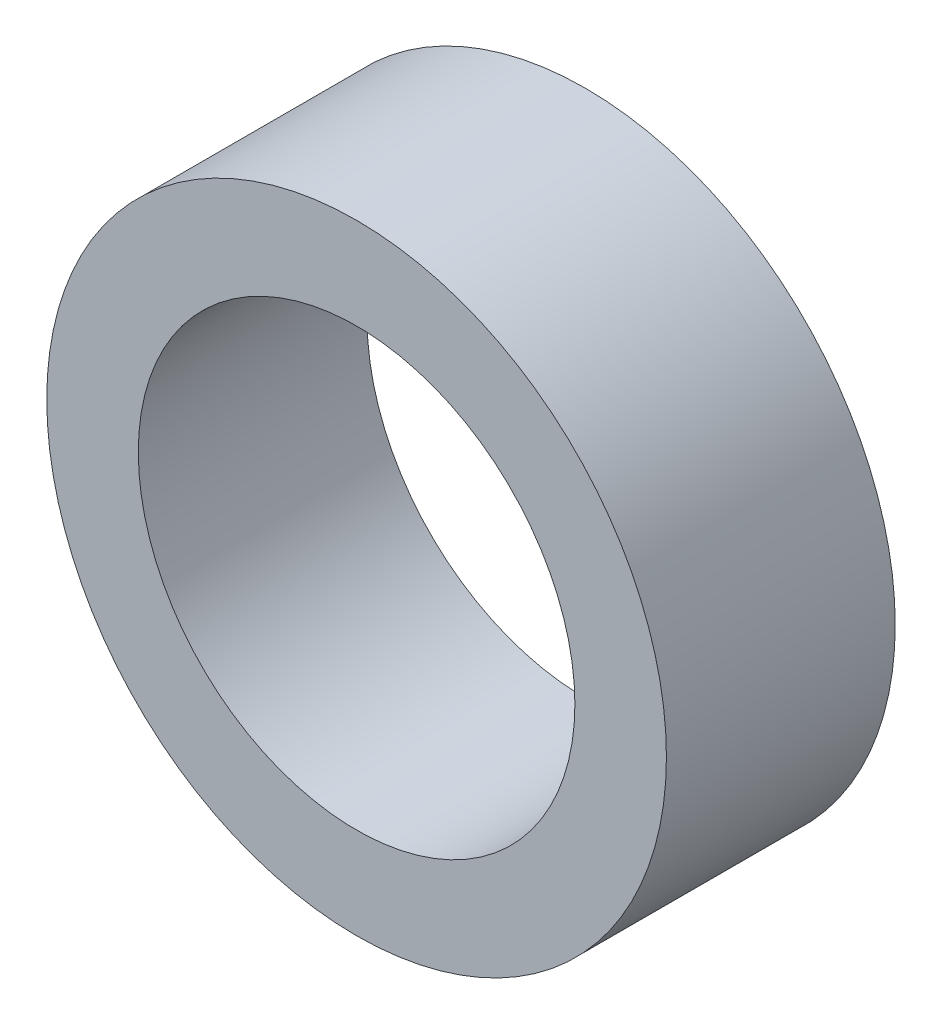
ISO-10303-21;
HEADER;
FILE_DESCRIPTION(('STEP AP214'),'2;1');
FILE_NAME('part.step','',(''),(''),'','','');
FILE_SCHEMA(('AUTOMOTIVE_DESIGN { 1 0 10303 214 1 1 1 1 }'));
ENDSEC;
DATA;
#1=APPLICATION_CONTEXT('core data for automotive mechanical design processes');
#2=APPLICATION_PROTOCOL_DEFINITION('international standard','automotive_design',2000,#1);
#3=PRODUCT_CONTEXT('',#1,'mechanical');
#4=PRODUCT('Part','Part','',(#3));
#5=PRODUCT_RELATED_PRODUCT_CATEGORY('part','',(#4));
#6=PRODUCT_DEFINITION_FORMATION('','',#4);
#7=PRODUCT_DEFINITION_CONTEXT('part definition',#1,'design');
#8=PRODUCT_DEFINITION('design','',#6,#7);
#9=PRODUCT_DEFINITION_SHAPE('','',#8);
#10=(LENGTH_UNIT() NAMED_UNIT(*) SI_UNIT(.MILLI.,.METRE.));
#11=(NAMED_UNIT(*) PLANE_ANGLE_UNIT() SI_UNIT($,.RADIAN.));
#12=(NAMED_UNIT(*) SI_UNIT($,.STERADIAN.) SOLID_ANGLE_UNIT());
#13=UNCERTAINTY_MEASURE_WITH_UNIT(LENGTH_MEASURE(1.E-05),#10,'distance_accuracy_value','');
#14=(GEOMETRIC_REPRESENTATION_CONTEXT(3) GLOBAL_UNCERTAINTY_ASSIGNED_CONTEXT((#13)) GLOBAL_UNIT_ASSIGNED_CONTEXT((#10,
#11,#12)) REPRESENTATION_CONTEXT('',''));
#15=CARTESIAN_POINT('',(0.,0.,0.));
#16=DIRECTION('',(0.,0.,1.));
#17=DIRECTION('',(1.,0.,0.));
#18=AXIS2_PLACEMENT_3D('',#15,#16,#17);
#19=CARTESIAN_POINT('',(0.,0.,6.35));
#20=DIRECTION('',(0.,0.,1.));
#21=DIRECTION('',(1.,0.,0.));
#22=AXIS2_PLACEMENT_3D('',#19,#20,#21);
#23=PLANE('',#22);
#24=CARTESIAN_POINT('',(0.,0.,6.35));
#25=DIRECTION('',(0.,0.,1.));
#26=DIRECTION('',(1.,0.,0.));
#27=AXIS2_PLACEMENT_3D('',#24,#25,#26);
#28=CIRCLE('',#27,8.598499948);
#29=CARTESIAN_POINT('',(8.598499948,0.,6.35));
#30=VERTEX_POINT('',#29);
#31=EDGE_CURVE('E10',#30,#30,#28,.T.);
#32=ORIENTED_EDGE('',*,*,#31,.T.);
#33=EDGE_LOOP('',(#32));
#34=FACE_BOUND('',#33,.T.);
#35=CARTESIAN_POINT('',(0.,0.,6.35));
#36=DIRECTION('',(0.,0.,1.));
#37=DIRECTION('',(1.,0.,0.));
#38=AXIS2_PLACEMENT_3D('',#35,#36,#37);
#39=CIRCLE('',#38,6.058499948);
#40=CARTESIAN_POINT('',(6.058499948,0.,6.35));
#41=VERTEX_POINT('',#40);
#42=EDGE_CURVE('E48',#41,#41,#39,.T.);
#43=ORIENTED_EDGE('',*,*,#42,.F.);
#44=EDGE_LOOP('',(#43));
#45=FACE_BOUND('',#44,.T.);
#46=ADVANCED_FACE('F37',(#34,#45),#23,.T.);
#47=CARTESIAN_POINT('',(0.,0.,0.));
#48=DIRECTION('',(0.,0.,1.));
#49=DIRECTION('',(1.,0.,0.));
#50=AXIS2_PLACEMENT_3D('',#47,#48,#49);
#51=PLANE('',#50);
#52=CARTESIAN_POINT('',(0.,0.,0.));
#53=DIRECTION('',(0.,0.,1.));
#54=DIRECTION('',(1.,0.,0.));
#55=AXIS2_PLACEMENT_3D('',#52,#53,#54);
#56=CIRCLE('',#55,8.598499948);
#57=CARTESIAN_POINT('',(8.598499948,0.,0.));
#58=VERTEX_POINT('',#57);
#59=EDGE_CURVE('E41',#58,#58,#56,.T.);
#60=ORIENTED_EDGE('',*,*,#59,.F.);
#61=EDGE_LOOP('',(#60));
#62=FACE_BOUND('',#61,.T.);
#63=CARTESIAN_POINT('',(0.,0.,0.));
#64=DIRECTION('',(0.,0.,1.));
#65=DIRECTION('',(1.,0.,0.));
#66=AXIS2_PLACEMENT_3D('',#63,#64,#65);
#67=CIRCLE('',#66,6.058499948);
#68=CARTESIAN_POINT('',(6.058499948,0.,0.));
#69=VERTEX_POINT('',#68);
#70=EDGE_CURVE('E50',#69,#69,#67,.T.);
#71=ORIENTED_EDGE('',*,*,#70,.T.);
#72=EDGE_LOOP('',(#71));
#73=FACE_BOUND('',#72,.T.);
#74=ADVANCED_FACE('F60',(#62,#73),#51,.F.);
#75=CARTESIAN_POINT('',(0.,0.,6.35));
#76=DIRECTION('',(0.,0.,-1.));
#77=DIRECTION('',(-1.,0.,0.));
#78=AXIS2_PLACEMENT_3D('',#75,#76,#77);
#79=CYLINDRICAL_SURFACE('',#78,8.598499948);
#80=ORIENTED_EDGE('',*,*,#31,.F.);
#81=EDGE_LOOP('',(#80));
#82=FACE_BOUND('',#81,.T.);
#83=ORIENTED_EDGE('',*,*,#59,.T.);
#84=EDGE_LOOP('',(#83));
#85=FACE_BOUND('',#84,.T.);
#86=ADVANCED_FACE('F39',(#82,#85),#79,.T.);
#87=CARTESIAN_POINT('',(0.,0.,6.35));
#88=DIRECTION('',(0.,0.,-1.));
#89=DIRECTION('',(-1.,0.,0.));
#90=AXIS2_PLACEMENT_3D('',#87,#88,#89);
#91=CYLINDRICAL_SURFACE('',#90,6.058499948);
#92=ORIENTED_EDGE('',*,*,#42,.T.);
#93=EDGE_LOOP('',(#92));
#94=FACE_BOUND('',#93,.T.);
#95=ORIENTED_EDGE('',*,*,#70,.F.);
#96=EDGE_LOOP('',(#95));
#97=FACE_BOUND('',#96,.T.);
#98=ADVANCED_FACE('F56',(#94,#97),#91,.F.);
#99=CLOSED_SHELL('',(#46,#74,#86,#98));
#100=MANIFOLD_SOLID_BREP('B2',#99);
#101=ADVANCED_BREP_SHAPE_REPRESENTATION('',(#18,#100),#14);
#102=SHAPE_DEFINITION_REPRESENTATION(#9,#101);
ENDSEC;
END-ISO-10303-21;
